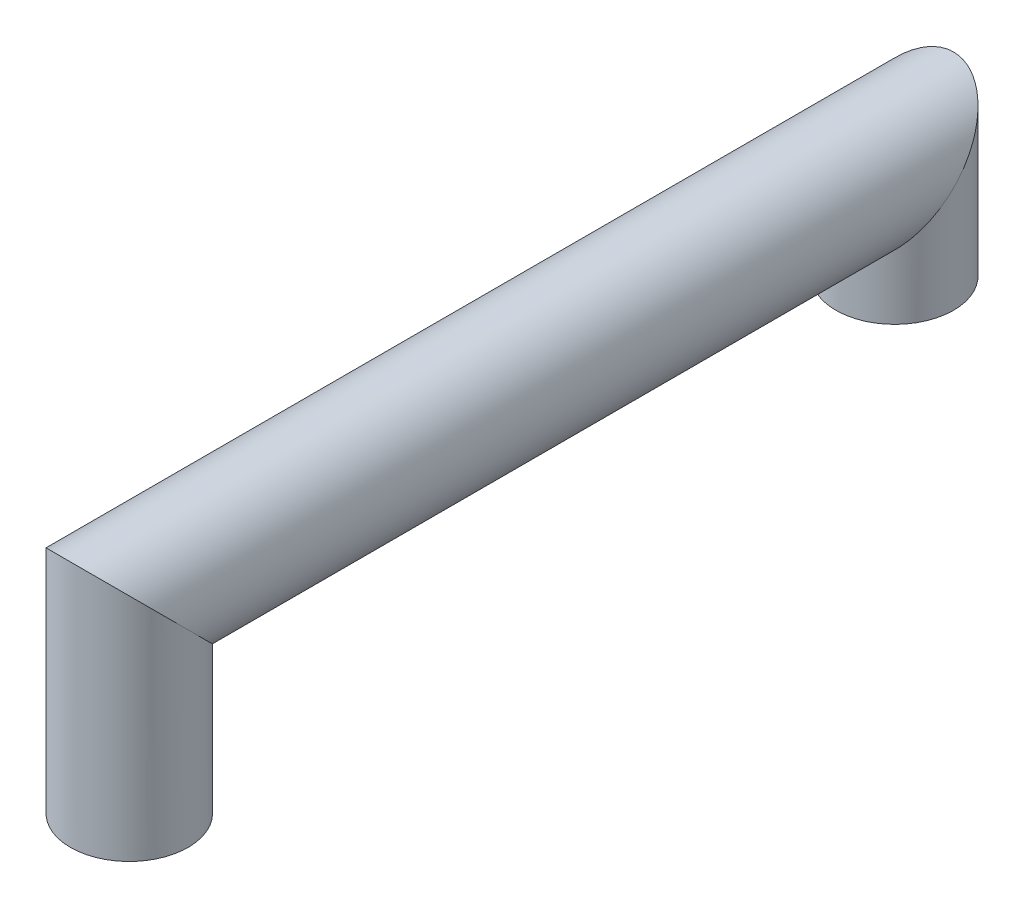
ISO-10303-21;
HEADER;
FILE_DESCRIPTION(('STEP AP214'),'2;1');
FILE_NAME('part.step','',(''),(''),'','','');
FILE_SCHEMA(('AUTOMOTIVE_DESIGN { 1 0 10303 214 1 1 1 1 }'));
ENDSEC;
DATA;
#1=APPLICATION_CONTEXT('core data for automotive mechanical design processes');
#2=APPLICATION_PROTOCOL_DEFINITION('international standard','automotive_design',2000,#1);
#3=PRODUCT_CONTEXT('',#1,'mechanical');
#4=PRODUCT('Part','Part','',(#3));
#5=PRODUCT_RELATED_PRODUCT_CATEGORY('part','',(#4));
#6=PRODUCT_DEFINITION_FORMATION('','',#4);
#7=PRODUCT_DEFINITION_CONTEXT('part definition',#1,'design');
#8=PRODUCT_DEFINITION('design','',#6,#7);
#9=PRODUCT_DEFINITION_SHAPE('','',#8);
#10=(LENGTH_UNIT() NAMED_UNIT(*) SI_UNIT(.MILLI.,.METRE.));
#11=(NAMED_UNIT(*) PLANE_ANGLE_UNIT() SI_UNIT($,.RADIAN.));
#12=(NAMED_UNIT(*) SI_UNIT($,.STERADIAN.) SOLID_ANGLE_UNIT());
#13=UNCERTAINTY_MEASURE_WITH_UNIT(LENGTH_MEASURE(1.E-05),#10,'distance_accuracy_value','');
#14=(GEOMETRIC_REPRESENTATION_CONTEXT(3) GLOBAL_UNCERTAINTY_ASSIGNED_CONTEXT((#13)) GLOBAL_UNIT_ASSIGNED_CONTEXT((#10,
#11,#12)) REPRESENTATION_CONTEXT('',''));
#15=CARTESIAN_POINT('',(0.,0.,0.));
#16=DIRECTION('',(0.,0.,1.));
#17=DIRECTION('',(1.,0.,0.));
#18=AXIS2_PLACEMENT_3D('',#15,#16,#17);
#19=CARTESIAN_POINT('',(0.,7.,-65.));
#20=DIRECTION('',(0.,-1.,0.));
#21=DIRECTION('',(0.,0.,-1.));
#22=AXIS2_PLACEMENT_3D('',#19,#20,#21);
#23=PLANE('',#22);
#24=CARTESIAN_POINT('',(0.,7.,-65.));
#25=DIRECTION('',(0.,-1.,0.));
#26=DIRECTION('',(0.,0.,-1.));
#27=AXIS2_PLACEMENT_3D('',#24,#25,#26);
#28=CIRCLE('',#27,5.);
#29=CARTESIAN_POINT('',(0.,7.,-70.));
#30=VERTEX_POINT('',#29);
#31=EDGE_CURVE('E40',#30,#30,#28,.T.);
#32=ORIENTED_EDGE('',*,*,#31,.T.);
#33=EDGE_LOOP('',(#32));
#34=FACE_BOUND('',#33,.T.);
#35=ADVANCED_FACE('F37',(#34),#23,.T.);
#36=CARTESIAN_POINT('',(0.,0.,0.));
#37=DIRECTION('',(0.,1.,0.));
#38=DIRECTION('',(0.,0.,1.));
#39=AXIS2_PLACEMENT_3D('',#36,#37,#38);
#40=PLANE('',#39);
#41=CARTESIAN_POINT('',(0.,0.,0.));
#42=DIRECTION('',(0.,1.,0.));
#43=DIRECTION('',(0.,0.,1.));
#44=AXIS2_PLACEMENT_3D('',#41,#42,#43);
#45=CIRCLE('',#44,5.);
#46=CARTESIAN_POINT('',(0.,0.,5.));
#47=VERTEX_POINT('',#46);
#48=EDGE_CURVE('E45',#47,#47,#45,.T.);
#49=ORIENTED_EDGE('',*,*,#48,.F.);
#50=EDGE_LOOP('',(#49));
#51=FACE_BOUND('',#50,.T.);
#52=ADVANCED_FACE('F65',(#51),#40,.F.);
#53=CARTESIAN_POINT('',(0.,21.6,-65.));
#54=DIRECTION('',(0.,-1.,0.));
#55=DIRECTION('',(0.,0.,-1.));
#56=AXIS2_PLACEMENT_3D('',#53,#54,#55);
#57=CYLINDRICAL_SURFACE('',#56,5.);
#58=CARTESIAN_POINT('',(0.,16.,-65.));
#59=DIRECTION('',(0.,-0.707106781186548,-0.707106781186548));
#60=DIRECTION('',(0.,0.707106781186548,-0.707106781186548));
#61=AXIS2_PLACEMENT_3D('',#58,#59,#60);
#62=ELLIPSE('',#61,7.07106781186548,5.);
#63=CARTESIAN_POINT('',(0.,21.,-70.));
#64=VERTEX_POINT('',#63);
#65=EDGE_CURVE('E51',#64,#64,#62,.F.);
#66=ORIENTED_EDGE('',*,*,#65,.F.);
#67=EDGE_LOOP('',(#66));
#68=FACE_BOUND('',#67,.T.);
#69=ORIENTED_EDGE('',*,*,#31,.F.);
#70=EDGE_LOOP('',(#69));
#71=FACE_BOUND('',#70,.T.);
#72=ADVANCED_FACE('F62',(#68,#71),#57,.T.);
#73=CARTESIAN_POINT('',(0.,16.,5.6));
#74=DIRECTION('',(0.,0.,-1.));
#75=DIRECTION('',(-1.,0.,0.));
#76=AXIS2_PLACEMENT_3D('',#73,#74,#75);
#77=CYLINDRICAL_SURFACE('',#76,5.);
#78=CARTESIAN_POINT('',(0.,16.,0.));
#79=DIRECTION('',(0.,0.707106781186548,-0.707106781186548));
#80=DIRECTION('',(0.,0.707106781186548,0.707106781186548));
#81=AXIS2_PLACEMENT_3D('',#78,#79,#80);
#82=ELLIPSE('',#81,7.07106781186548,5.);
#83=CARTESIAN_POINT('',(0.,21.,5.));
#84=VERTEX_POINT('',#83);
#85=EDGE_CURVE('E10',#84,#84,#82,.F.);
#86=ORIENTED_EDGE('',*,*,#85,.F.);
#87=EDGE_LOOP('',(#86));
#88=FACE_BOUND('',#87,.T.);
#89=ORIENTED_EDGE('',*,*,#65,.T.);
#90=EDGE_LOOP('',(#89));
#91=FACE_BOUND('',#90,.T.);
#92=ADVANCED_FACE('F64',(#88,#91),#77,.T.);
#93=CARTESIAN_POINT('',(0.,0.,0.));
#94=DIRECTION('',(0.,1.,0.));
#95=DIRECTION('',(0.,0.,1.));
#96=AXIS2_PLACEMENT_3D('',#93,#94,#95);
#97=CYLINDRICAL_SURFACE('',#96,5.);
#98=ORIENTED_EDGE('',*,*,#48,.T.);
#99=EDGE_LOOP('',(#98));
#100=FACE_BOUND('',#99,.T.);
#101=ORIENTED_EDGE('',*,*,#85,.T.);
#102=EDGE_LOOP('',(#101));
#103=FACE_BOUND('',#102,.T.);
#104=ADVANCED_FACE('F72',(#100,#103),#97,.T.);
#105=CLOSED_SHELL('',(#35,#52,#72,#92,#104));
#106=MANIFOLD_SOLID_BREP('B2',#105);
#107=ADVANCED_BREP_SHAPE_REPRESENTATION('',(#18,#106),#14);
#108=SHAPE_DEFINITION_REPRESENTATION(#9,#107);
ENDSEC;
END-ISO-10303-21;
